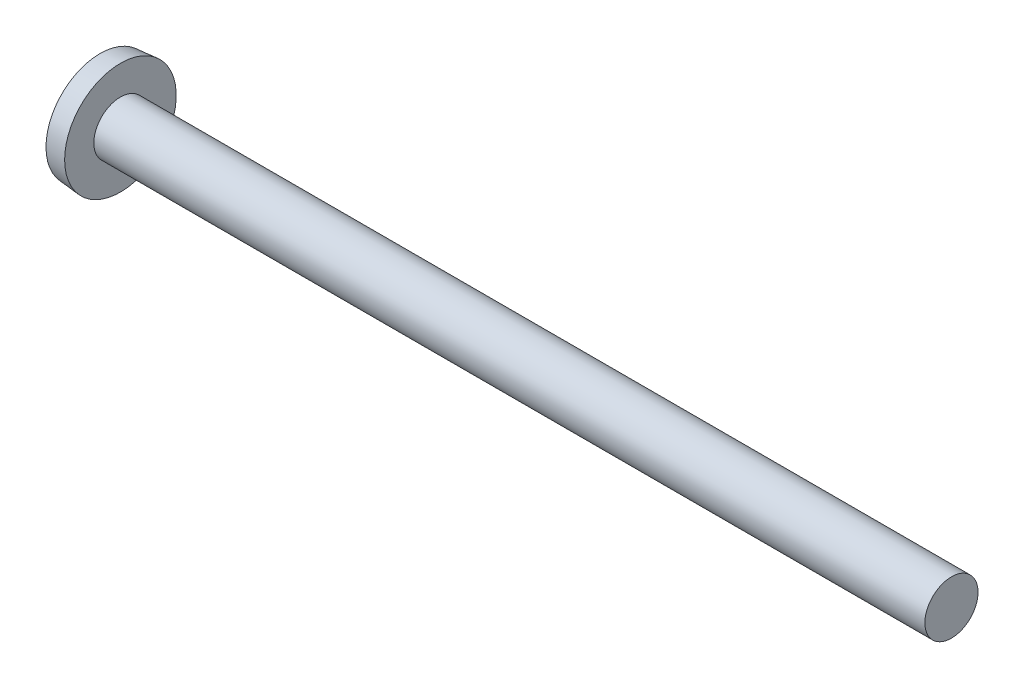
ISO-10303-21;
HEADER;
FILE_DESCRIPTION(('STEP AP214'),'2;1');
FILE_NAME('part.step','',(''),(''),'','','');
FILE_SCHEMA(('AUTOMOTIVE_DESIGN { 1 0 10303 214 1 1 1 1 }'));
ENDSEC;
DATA;
#1=APPLICATION_CONTEXT('core data for automotive mechanical design processes');
#2=APPLICATION_PROTOCOL_DEFINITION('international standard','automotive_design',2000,#1);
#3=PRODUCT_CONTEXT('',#1,'mechanical');
#4=PRODUCT('Part','Part','',(#3));
#5=PRODUCT_RELATED_PRODUCT_CATEGORY('part','',(#4));
#6=PRODUCT_DEFINITION_FORMATION('','',#4);
#7=PRODUCT_DEFINITION_CONTEXT('part definition',#1,'design');
#8=PRODUCT_DEFINITION('design','',#6,#7);
#9=PRODUCT_DEFINITION_SHAPE('','',#8);
#10=(LENGTH_UNIT() NAMED_UNIT(*) SI_UNIT(.MILLI.,.METRE.));
#11=(NAMED_UNIT(*) PLANE_ANGLE_UNIT() SI_UNIT($,.RADIAN.));
#12=(NAMED_UNIT(*) SI_UNIT($,.STERADIAN.) SOLID_ANGLE_UNIT());
#13=UNCERTAINTY_MEASURE_WITH_UNIT(LENGTH_MEASURE(1.E-05),#10,'distance_accuracy_value','');
#14=(GEOMETRIC_REPRESENTATION_CONTEXT(3) GLOBAL_UNCERTAINTY_ASSIGNED_CONTEXT((#13)) GLOBAL_UNIT_ASSIGNED_CONTEXT((#10,
#11,#12)) REPRESENTATION_CONTEXT('',''));
#15=CARTESIAN_POINT('',(0.,0.,0.));
#16=DIRECTION('',(0.,0.,1.));
#17=DIRECTION('',(1.,0.,0.));
#18=AXIS2_PLACEMENT_3D('',#15,#16,#17);
#19=CARTESIAN_POINT('',(6.88915553502617,0.,0.));
#20=DIRECTION('',(-1.,0.,0.));
#21=DIRECTION('',(0.,1.,0.));
#22=AXIS2_PLACEMENT_3D('',#19,#20,#21);
#23=SPHERICAL_SURFACE('',#22,6.88915553502617);
#24=CARTESIAN_POINT('',(0.635,0.,0.));
#25=DIRECTION('',(-1.,0.,0.));
#26=DIRECTION('',(0.,0.,1.));
#27=AXIS2_PLACEMENT_3D('',#24,#25,#26);
#28=CIRCLE('',#27,2.88894488169699);
#29=CARTESIAN_POINT('',(0.635,0.,2.88894488169699));
#30=VERTEX_POINT('',#29);
#31=EDGE_CURVE('E155',#30,#30,#28,.T.);
#32=ORIENTED_EDGE('',*,*,#31,.T.);
#33=EDGE_LOOP('',(#32));
#34=FACE_BOUND('',#33,.T.);
#35=CARTESIAN_POINT('',(6.86477289017555,0.,-0.246694994959211));
#36=DIRECTION('',(-0.0983579575755382,0.,-0.995151100176033));
#37=DIRECTION('',(-0.995151100176033,0.,0.0983579575755382));
#38=AXIS2_PLACEMENT_3D('',#35,#36,#37);
#39=CIRCLE('',#38,6.88469396936958);
#40=CARTESIAN_POINT('',(0.241932323899223,1.76309809084771,0.407888084265775));
#41=VERTEX_POINT('',#40);
#42=CARTESIAN_POINT('',(0.0267856736692355,0.429152578765249,0.42915257876525));
#43=VERTEX_POINT('',#42);
#44=EDGE_CURVE('E126',#41,#43,#39,.F.);
#45=ORIENTED_EDGE('',*,*,#44,.T.);
#46=CARTESIAN_POINT('',(6.86477289017555,-0.246694994959212,0.));
#47=DIRECTION('',(-0.0983579575755383,-0.995151100176033,0.));
#48=DIRECTION('',(0.995151100176033,-0.0983579575755383,0.));
#49=AXIS2_PLACEMENT_3D('',#46,#47,#48);
#50=CIRCLE('',#49,6.88469396936958);
#51=CARTESIAN_POINT('',(0.241932323899221,0.407888084265769,1.76309809084772));
#52=VERTEX_POINT('',#51);
#53=EDGE_CURVE('E107',#43,#52,#50,.F.);
#54=ORIENTED_EDGE('',*,*,#53,.T.);
#55=CARTESIAN_POINT('',(5.16814362186864,0.,-2.16068648951165));
#56=DIRECTION('',(0.623029850364346,0.,0.782198060311441));
#57=DIRECTION('',(0.782198060311441,0.,-0.623029850364346));
#58=AXIS2_PLACEMENT_3D('',#55,#56,#57);
#59=CIRCLE('',#58,6.31110258786794);
#60=CARTESIAN_POINT('',(0.241932323899221,-0.407888084265781,1.76309809084771));
#61=VERTEX_POINT('',#60);
#62=EDGE_CURVE('E118',#61,#52,#59,.F.);
#63=ORIENTED_EDGE('',*,*,#62,.F.);
#64=CARTESIAN_POINT('',(6.86477289017555,0.246694994959211,0.));
#65=DIRECTION('',(-0.0983579575755382,0.995151100176033,0.));
#66=DIRECTION('',(-0.995151100176033,-0.0983579575755382,0.));
#67=AXIS2_PLACEMENT_3D('',#64,#65,#66);
#68=CIRCLE('',#67,6.88469396936958);
#69=CARTESIAN_POINT('',(0.0267856736692364,-0.429152578765251,0.42915257876525));
#70=VERTEX_POINT('',#69);
#71=EDGE_CURVE('E193',#61,#70,#68,.F.);
#72=ORIENTED_EDGE('',*,*,#71,.T.);
#73=CARTESIAN_POINT('',(0.241932323899219,-1.76309809084771,0.407888084265775));
#74=VERTEX_POINT('',#73);
#75=EDGE_CURVE('E163',#70,#74,#39,.F.);
#76=ORIENTED_EDGE('',*,*,#75,.T.);
#77=CARTESIAN_POINT('',(5.16814362186863,2.16068648951164,0.));
#78=DIRECTION('',(0.623029850364346,-0.782198060311441,0.));
#79=DIRECTION('',(0.782198060311441,0.623029850364346,0.));
#80=AXIS2_PLACEMENT_3D('',#77,#78,#79);
#81=CIRCLE('',#80,6.31110258786794);
#82=CARTESIAN_POINT('',(0.24193232389922,-1.76309809084771,-0.407888084265775));
#83=VERTEX_POINT('',#82);
#84=EDGE_CURVE('E161',#83,#74,#81,.F.);
#85=ORIENTED_EDGE('',*,*,#84,.F.);
#86=CARTESIAN_POINT('',(6.86477289017555,0.,0.246694994959212));
#87=DIRECTION('',(-0.0983579575755383,0.,0.995151100176033));
#88=DIRECTION('',(0.995151100176033,0.,0.0983579575755383));
#89=AXIS2_PLACEMENT_3D('',#86,#87,#88);
#90=CIRCLE('',#89,6.88469396936958);
#91=CARTESIAN_POINT('',(0.0267856736692364,-0.429152578765248,-0.42915257876525));
#92=VERTEX_POINT('',#91);
#93=EDGE_CURVE('E165',#83,#92,#90,.F.);
#94=ORIENTED_EDGE('',*,*,#93,.T.);
#95=CARTESIAN_POINT('',(0.241932323899221,-0.407888084265769,-1.76309809084771));
#96=VERTEX_POINT('',#95);
#97=EDGE_CURVE('E191',#92,#96,#68,.F.);
#98=ORIENTED_EDGE('',*,*,#97,.T.);
#99=CARTESIAN_POINT('',(5.16814362186864,0.,2.16068648951165));
#100=DIRECTION('',(0.623029850364346,0.,-0.782198060311441));
#101=DIRECTION('',(-0.782198060311441,0.,-0.623029850364346));
#102=AXIS2_PLACEMENT_3D('',#99,#100,#101);
#103=CIRCLE('',#102,6.31110258786794);
#104=CARTESIAN_POINT('',(0.241932323899222,0.407888084265781,-1.76309809084771));
#105=VERTEX_POINT('',#104);
#106=EDGE_CURVE('E119',#105,#96,#103,.F.);
#107=ORIENTED_EDGE('',*,*,#106,.F.);
#108=CARTESIAN_POINT('',(0.0267856736692364,0.429152578765252,-0.42915257876525));
#109=VERTEX_POINT('',#108);
#110=EDGE_CURVE('E142',#105,#109,#50,.F.);
#111=ORIENTED_EDGE('',*,*,#110,.T.);
#112=CARTESIAN_POINT('',(0.241932323899223,1.76309809084771,-0.407888084265775));
#113=VERTEX_POINT('',#112);
#114=EDGE_CURVE('E58',#109,#113,#90,.F.);
#115=ORIENTED_EDGE('',*,*,#114,.T.);
#116=CARTESIAN_POINT('',(5.16814362186864,-2.16068648951165,0.));
#117=DIRECTION('',(0.623029850364346,0.782198060311441,0.));
#118=DIRECTION('',(-0.782198060311441,0.623029850364346,0.));
#119=AXIS2_PLACEMENT_3D('',#116,#117,#118);
#120=CIRCLE('',#119,6.31110258786794);
#121=EDGE_CURVE('E43',#41,#113,#120,.F.);
#122=ORIENTED_EDGE('',*,*,#121,.F.);
#123=EDGE_LOOP('',(#45,#54,#63,#72,#76,#85,#94,#98,#107,#111,#115,#122));
#124=FACE_BOUND('',#123,.T.);
#125=ADVANCED_FACE('F35',(#34,#124),#23,.T.);
#126=CARTESIAN_POINT('',(2.45545693430657,0.,-0.189109489051095));
#127=DIRECTION('',(-0.0983579575755383,0.,0.995151100176033));
#128=DIRECTION('',(0.995151100176033,0.,0.0983579575755383));
#129=AXIS2_PLACEMENT_3D('',#126,#127,#128);
#130=PLANE('',#129);
#131=ORIENTED_EDGE('',*,*,#114,.F.);
#132=DIRECTION('',(0.990372058640007,-0.0978856104469779,0.0978856104469775));
#133=VECTOR('',#132,1.);
#134=CARTESIAN_POINT('',(2.47378980831975,0.187297518945142,-0.187297518945141));
#135=LINE('',#134,#133);
#136=CARTESIAN_POINT('',(2.1844,0.215900000000001,-0.215899999999999));
#137=VERTEX_POINT('',#136);
#138=EDGE_CURVE('E144',#109,#137,#135,.T.);
#139=ORIENTED_EDGE('',*,*,#138,.T.);
#140=DIRECTION('',(0.779870935502331,-0.621176268394299,0.0770802668810444));
#141=VECTOR('',#140,1.);
#142=CARTESIAN_POINT('',(0.,1.9558,-0.4318));
#143=LINE('',#142,#141);
#144=EDGE_CURVE('E128',#113,#137,#143,.T.);
#145=ORIENTED_EDGE('',*,*,#144,.F.);
#146=EDGE_LOOP('',(#131,#139,#145));
#147=FACE_BOUND('',#146,.T.);
#148=ADVANCED_FACE('F169',(#147),#130,.T.);
#149=DIRECTION('',(0.779870935502331,0.621176268394299,0.0770802668810446));
#150=VECTOR('',#149,1.);
#151=CARTESIAN_POINT('',(0.,-1.9558,-0.431800000000001));
#152=LINE('',#151,#150);
#153=CARTESIAN_POINT('',(2.1844,-0.2159,-0.2159));
#154=VERTEX_POINT('',#153);
#155=EDGE_CURVE('E50',#83,#154,#152,.T.);
#156=ORIENTED_EDGE('',*,*,#155,.T.);
#157=DIRECTION('',(-0.990372058640007,-0.0978856104469771,-0.0978856104469776));
#158=VECTOR('',#157,1.);
#159=CARTESIAN_POINT('',(2.47378980831974,-0.187297518945141,-0.187297518945142));
#160=LINE('',#159,#158);
#161=EDGE_CURVE('E189',#154,#92,#160,.T.);
#162=ORIENTED_EDGE('',*,*,#161,.T.);
#163=ORIENTED_EDGE('',*,*,#93,.F.);
#164=EDGE_LOOP('',(#156,#162,#163));
#165=FACE_BOUND('',#164,.T.);
#166=ADVANCED_FACE('F195',(#165),#130,.T.);
#167=CARTESIAN_POINT('',(2.45545693430657,0.,0.189109489051095));
#168=DIRECTION('',(-0.0983579575755382,0.,-0.995151100176033));
#169=DIRECTION('',(-0.995151100176033,0.,0.0983579575755382));
#170=AXIS2_PLACEMENT_3D('',#167,#168,#169);
#171=PLANE('',#170);
#172=DIRECTION('',(0.779870935502331,-0.621176268394299,-0.0770802668810444));
#173=VECTOR('',#172,1.);
#174=CARTESIAN_POINT('',(0.,1.9558,0.4318));
#175=LINE('',#174,#173);
#176=CARTESIAN_POINT('',(2.1844,0.215899999999999,0.215900000000001));
#177=VERTEX_POINT('',#176);
#178=EDGE_CURVE('E123',#41,#177,#175,.T.);
#179=ORIENTED_EDGE('',*,*,#178,.T.);
#180=DIRECTION('',(-0.990372058640007,0.0978856104469772,0.0978856104469775));
#181=VECTOR('',#180,1.);
#182=CARTESIAN_POINT('',(2.47378980831974,0.187297518945141,0.187297518945141));
#183=LINE('',#182,#181);
#184=EDGE_CURVE('E11',#177,#43,#183,.T.);
#185=ORIENTED_EDGE('',*,*,#184,.T.);
#186=ORIENTED_EDGE('',*,*,#44,.F.);
#187=EDGE_LOOP('',(#179,#185,#186));
#188=FACE_BOUND('',#187,.T.);
#189=ADVANCED_FACE('F125',(#188),#171,.T.);
#190=ORIENTED_EDGE('',*,*,#75,.F.);
#191=DIRECTION('',(0.990372058640007,0.0978856104469778,-0.0978856104469774));
#192=VECTOR('',#191,1.);
#193=CARTESIAN_POINT('',(2.47378980831975,-0.187297518945142,0.187297518945141));
#194=LINE('',#193,#192);
#195=CARTESIAN_POINT('',(2.1844,-0.2159,0.2159));
#196=VERTEX_POINT('',#195);
#197=EDGE_CURVE('E203',#70,#196,#194,.T.);
#198=ORIENTED_EDGE('',*,*,#197,.T.);
#199=DIRECTION('',(0.779870935502331,0.621176268394299,-0.0770802668810444));
#200=VECTOR('',#199,1.);
#201=CARTESIAN_POINT('',(0.,-1.9558,0.4318));
#202=LINE('',#201,#200);
#203=EDGE_CURVE('E174',#74,#196,#202,.T.);
#204=ORIENTED_EDGE('',*,*,#203,.F.);
#205=EDGE_LOOP('',(#190,#198,#204));
#206=FACE_BOUND('',#205,.T.);
#207=ADVANCED_FACE('F202',(#206),#171,.T.);
#208=CARTESIAN_POINT('',(-25.4,0.,0.));
#209=DIRECTION('',(-1.,0.,0.));
#210=DIRECTION('',(0.,0.,1.));
#211=AXIS2_PLACEMENT_3D('',#208,#209,#210);
#212=CYLINDRICAL_SURFACE('',#211,1.4224);
#213=CARTESIAN_POINT('',(46.1772,0.,0.));
#214=DIRECTION('',(-1.,0.,0.));
#215=DIRECTION('',(0.,0.,1.));
#216=AXIS2_PLACEMENT_3D('',#213,#214,#215);
#217=CIRCLE('',#216,1.4224);
#218=CARTESIAN_POINT('',(46.1772,0.,1.4224));
#219=VERTEX_POINT('',#218);
#220=EDGE_CURVE('E158',#219,#219,#217,.T.);
#221=ORIENTED_EDGE('',*,*,#220,.T.);
#222=EDGE_LOOP('',(#221));
#223=FACE_BOUND('',#222,.T.);
#224=CARTESIAN_POINT('',(1.7272,0.,0.));
#225=DIRECTION('',(-1.,0.,0.));
#226=DIRECTION('',(0.,0.,1.));
#227=AXIS2_PLACEMENT_3D('',#224,#225,#226);
#228=CIRCLE('',#227,1.4224);
#229=CARTESIAN_POINT('',(1.7272,0.,1.4224));
#230=VERTEX_POINT('',#229);
#231=EDGE_CURVE('E149',#230,#230,#228,.T.);
#232=ORIENTED_EDGE('',*,*,#231,.F.);
#233=EDGE_LOOP('',(#232));
#234=FACE_BOUND('',#233,.T.);
#235=ADVANCED_FACE('F37',(#223,#234),#212,.T.);
#236=CARTESIAN_POINT('',(46.1772,1.4224,0.));
#237=DIRECTION('',(1.,0.,0.));
#238=DIRECTION('',(0.,0.,-1.));
#239=AXIS2_PLACEMENT_3D('',#236,#237,#238);
#240=PLANE('',#239);
#241=ORIENTED_EDGE('',*,*,#220,.F.);
#242=EDGE_LOOP('',(#241));
#243=FACE_BOUND('',#242,.T.);
#244=ADVANCED_FACE('F234',(#243),#240,.T.);
#245=CARTESIAN_POINT('',(1.7272,0.,0.));
#246=DIRECTION('',(1.,0.,0.));
#247=DIRECTION('',(0.,0.,-1.));
#248=AXIS2_PLACEMENT_3D('',#245,#246,#247);
#249=CONICAL_SURFACE('',#248,2.9845,0.0872664625997163);
#250=ORIENTED_EDGE('',*,*,#31,.F.);
#251=EDGE_LOOP('',(#250));
#252=FACE_BOUND('',#251,.T.);
#253=CARTESIAN_POINT('',(1.7272,0.,0.));
#254=DIRECTION('',(-1.,0.,0.));
#255=DIRECTION('',(0.,0.,1.));
#256=AXIS2_PLACEMENT_3D('',#253,#254,#255);
#257=CIRCLE('',#256,2.9845);
#258=CARTESIAN_POINT('',(1.7272,0.,2.9845));
#259=VERTEX_POINT('',#258);
#260=EDGE_CURVE('E152',#259,#259,#257,.T.);
#261=ORIENTED_EDGE('',*,*,#260,.T.);
#262=EDGE_LOOP('',(#261));
#263=FACE_BOUND('',#262,.T.);
#264=ADVANCED_FACE('F232',(#252,#263),#249,.T.);
#265=CARTESIAN_POINT('',(1.7272,1.4224,0.));
#266=DIRECTION('',(-1.,0.,0.));
#267=DIRECTION('',(0.,0.,1.));
#268=AXIS2_PLACEMENT_3D('',#265,#266,#267);
#269=PLANE('',#268);
#270=ORIENTED_EDGE('',*,*,#260,.F.);
#271=EDGE_LOOP('',(#270));
#272=FACE_BOUND('',#271,.T.);
#273=ORIENTED_EDGE('',*,*,#231,.T.);
#274=EDGE_LOOP('',(#273));
#275=FACE_BOUND('',#274,.T.);
#276=ADVANCED_FACE('F241',(#272,#275),#269,.F.);
#277=CARTESIAN_POINT('',(2.1844,0.2159,0.2159));
#278=DIRECTION('',(-1.,0.,0.));
#279=DIRECTION('',(0.,0.,1.));
#280=AXIS2_PLACEMENT_3D('',#277,#278,#279);
#281=PLANE('',#280);
#282=DIRECTION('',(0.,1.,0.));
#283=VECTOR('',#282,1.);
#284=CARTESIAN_POINT('',(2.1844,-0.2159,0.2159));
#285=LINE('',#284,#283);
#286=EDGE_CURVE('E115',#196,#177,#285,.T.);
#287=ORIENTED_EDGE('',*,*,#286,.T.);
#288=DIRECTION('',(0.,0.,-1.));
#289=VECTOR('',#288,1.);
#290=CARTESIAN_POINT('',(2.1844,0.2159,0.2159));
#291=LINE('',#290,#289);
#292=EDGE_CURVE('E132',#177,#137,#291,.T.);
#293=ORIENTED_EDGE('',*,*,#292,.T.);
#294=DIRECTION('',(0.,-1.,0.));
#295=VECTOR('',#294,1.);
#296=CARTESIAN_POINT('',(2.1844,0.2159,-0.2159));
#297=LINE('',#296,#295);
#298=EDGE_CURVE('E137',#137,#154,#297,.T.);
#299=ORIENTED_EDGE('',*,*,#298,.T.);
#300=DIRECTION('',(0.,0.,1.));
#301=VECTOR('',#300,1.);
#302=CARTESIAN_POINT('',(2.1844,-0.2159,-0.2159));
#303=LINE('',#302,#301);
#304=EDGE_CURVE('E141',#154,#196,#303,.T.);
#305=ORIENTED_EDGE('',*,*,#304,.T.);
#306=EDGE_LOOP('',(#287,#293,#299,#305));
#307=FACE_BOUND('',#306,.T.);
#308=ADVANCED_FACE('F140',(#307),#281,.T.);
#309=CARTESIAN_POINT('',(2.1844,0.2159,0.2159));
#310=DIRECTION('',(0.623029850364346,0.782198060311441,0.));
#311=DIRECTION('',(-0.782198060311441,0.623029850364346,0.));
#312=AXIS2_PLACEMENT_3D('',#309,#310,#311);
#313=PLANE('',#312);
#314=ORIENTED_EDGE('',*,*,#121,.T.);
#315=ORIENTED_EDGE('',*,*,#144,.T.);
#316=ORIENTED_EDGE('',*,*,#292,.F.);
#317=ORIENTED_EDGE('',*,*,#178,.F.);
#318=EDGE_LOOP('',(#314,#315,#316,#317));
#319=FACE_BOUND('',#318,.T.);
#320=ADVANCED_FACE('F133',(#319),#313,.F.);
#321=CARTESIAN_POINT('',(2.1844,-0.2159,-0.2159));
#322=DIRECTION('',(0.623029850364346,-0.782198060311441,0.));
#323=DIRECTION('',(0.782198060311441,0.623029850364346,0.));
#324=AXIS2_PLACEMENT_3D('',#321,#322,#323);
#325=PLANE('',#324);
#326=ORIENTED_EDGE('',*,*,#84,.T.);
#327=ORIENTED_EDGE('',*,*,#203,.T.);
#328=ORIENTED_EDGE('',*,*,#304,.F.);
#329=ORIENTED_EDGE('',*,*,#155,.F.);
#330=EDGE_LOOP('',(#326,#327,#328,#329));
#331=FACE_BOUND('',#330,.T.);
#332=ADVANCED_FACE('F197',(#331),#325,.F.);
#333=CARTESIAN_POINT('',(2.45545693430657,0.189109489051095,0.));
#334=DIRECTION('',(-0.0983579575755383,-0.995151100176033,0.));
#335=DIRECTION('',(0.995151100176033,-0.0983579575755383,0.));
#336=AXIS2_PLACEMENT_3D('',#333,#334,#335);
#337=PLANE('',#336);
#338=ORIENTED_EDGE('',*,*,#184,.F.);
#339=DIRECTION('',(0.779870935502331,-0.0770802668810422,-0.621176268394299));
#340=VECTOR('',#339,1.);
#341=CARTESIAN_POINT('',(0.,0.431799999999993,1.9558));
#342=LINE('',#341,#340);
#343=EDGE_CURVE('E105',#52,#177,#342,.T.);
#344=ORIENTED_EDGE('',*,*,#343,.F.);
#345=ORIENTED_EDGE('',*,*,#53,.F.);
#346=EDGE_LOOP('',(#338,#344,#345));
#347=FACE_BOUND('',#346,.T.);
#348=ADVANCED_FACE('F104',(#347),#337,.T.);
#349=CARTESIAN_POINT('',(2.45545693430657,-0.189109489051095,0.));
#350=DIRECTION('',(-0.0983579575755382,0.995151100176033,0.));
#351=DIRECTION('',(-0.995151100176033,-0.0983579575755382,0.));
#352=AXIS2_PLACEMENT_3D('',#349,#350,#351);
#353=PLANE('',#352);
#354=DIRECTION('',(0.779870935502331,0.0770802668810465,-0.621176268394298));
#355=VECTOR('',#354,1.);
#356=CARTESIAN_POINT('',(0.,-0.431800000000007,1.9558));
#357=LINE('',#356,#355);
#358=EDGE_CURVE('E120',#61,#196,#357,.T.);
#359=ORIENTED_EDGE('',*,*,#358,.T.);
#360=ORIENTED_EDGE('',*,*,#197,.F.);
#361=ORIENTED_EDGE('',*,*,#71,.F.);
#362=EDGE_LOOP('',(#359,#360,#361));
#363=FACE_BOUND('',#362,.T.);
#364=ADVANCED_FACE('F210',(#363),#353,.T.);
#365=CARTESIAN_POINT('',(2.1844,-0.215900000000001,0.215899999999999));
#366=DIRECTION('',(0.623029850364346,0.,0.782198060311441));
#367=DIRECTION('',(-0.782198060311441,0.,0.623029850364346));
#368=AXIS2_PLACEMENT_3D('',#365,#366,#367);
#369=PLANE('',#368);
#370=ORIENTED_EDGE('',*,*,#62,.T.);
#371=ORIENTED_EDGE('',*,*,#343,.T.);
#372=ORIENTED_EDGE('',*,*,#286,.F.);
#373=ORIENTED_EDGE('',*,*,#358,.F.);
#374=EDGE_LOOP('',(#370,#371,#372,#373));
#375=FACE_BOUND('',#374,.T.);
#376=ADVANCED_FACE('F112',(#375),#369,.F.);
#377=DIRECTION('',(0.779870935502331,-0.0770802668810467,0.621176268394298));
#378=VECTOR('',#377,1.);
#379=CARTESIAN_POINT('',(0.,0.431800000000007,-1.9558));
#380=LINE('',#379,#378);
#381=EDGE_CURVE('E180',#105,#137,#380,.T.);
#382=ORIENTED_EDGE('',*,*,#381,.T.);
#383=ORIENTED_EDGE('',*,*,#138,.F.);
#384=ORIENTED_EDGE('',*,*,#110,.F.);
#385=EDGE_LOOP('',(#382,#383,#384));
#386=FACE_BOUND('',#385,.T.);
#387=ADVANCED_FACE('F214',(#386),#337,.T.);
#388=ORIENTED_EDGE('',*,*,#161,.F.);
#389=DIRECTION('',(0.779870935502331,0.0770802668810422,0.621176268394299));
#390=VECTOR('',#389,1.);
#391=CARTESIAN_POINT('',(0.,-0.431799999999993,-1.9558));
#392=LINE('',#391,#390);
#393=EDGE_CURVE('E183',#96,#154,#392,.T.);
#394=ORIENTED_EDGE('',*,*,#393,.F.);
#395=ORIENTED_EDGE('',*,*,#97,.F.);
#396=EDGE_LOOP('',(#388,#394,#395));
#397=FACE_BOUND('',#396,.T.);
#398=ADVANCED_FACE('F190',(#397),#353,.T.);
#399=CARTESIAN_POINT('',(2.1844,0.215900000000001,-0.215899999999999));
#400=DIRECTION('',(0.623029850364346,0.,-0.782198060311441));
#401=DIRECTION('',(0.782198060311441,0.,0.623029850364346));
#402=AXIS2_PLACEMENT_3D('',#399,#400,#401);
#403=PLANE('',#402);
#404=ORIENTED_EDGE('',*,*,#106,.T.);
#405=ORIENTED_EDGE('',*,*,#393,.T.);
#406=ORIENTED_EDGE('',*,*,#298,.F.);
#407=ORIENTED_EDGE('',*,*,#381,.F.);
#408=EDGE_LOOP('',(#404,#405,#406,#407));
#409=FACE_BOUND('',#408,.T.);
#410=ADVANCED_FACE('F179',(#409),#403,.F.);
#411=CLOSED_SHELL('',(#125,#148,#166,#189,#207,#235,#244,#264,#276,#308,#320,#332,#348,#364,
#376,#387,#398,#410));
#412=MANIFOLD_SOLID_BREP('B2',#411);
#413=ADVANCED_BREP_SHAPE_REPRESENTATION('',(#18,#412),#14);
#414=SHAPE_DEFINITION_REPRESENTATION(#9,#413);
ENDSEC;
END-ISO-10303-21;
